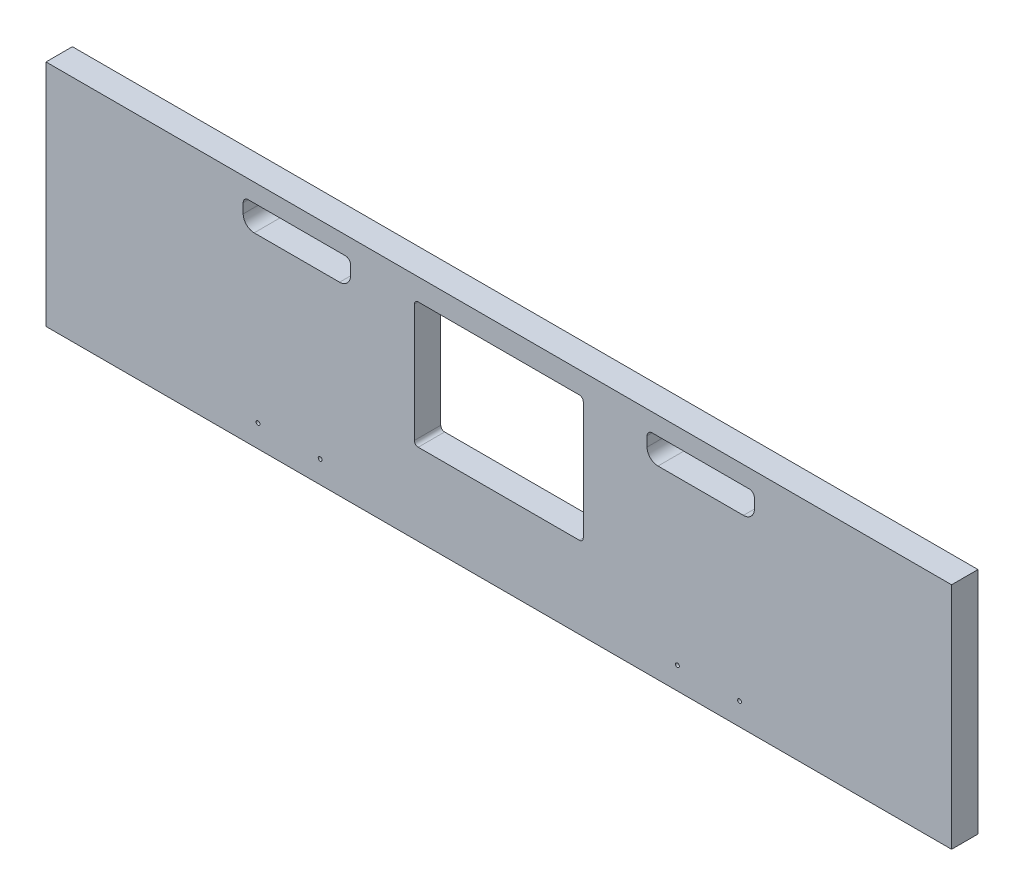
ISO-10303-21;
HEADER;
FILE_DESCRIPTION(('STEP AP214'),'2;1');
FILE_NAME('part.step','',(''),(''),'','','');
FILE_SCHEMA(('AUTOMOTIVE_DESIGN { 1 0 10303 214 1 1 1 1 }'));
ENDSEC;
DATA;
#1=APPLICATION_CONTEXT('core data for automotive mechanical design processes');
#2=APPLICATION_PROTOCOL_DEFINITION('international standard','automotive_design',2000,#1);
#3=PRODUCT_CONTEXT('',#1,'mechanical');
#4=PRODUCT('Part','Part','',(#3));
#5=PRODUCT_RELATED_PRODUCT_CATEGORY('part','',(#4));
#6=PRODUCT_DEFINITION_FORMATION('','',#4);
#7=PRODUCT_DEFINITION_CONTEXT('part definition',#1,'design');
#8=PRODUCT_DEFINITION('design','',#6,#7);
#9=PRODUCT_DEFINITION_SHAPE('','',#8);
#10=(LENGTH_UNIT() NAMED_UNIT(*) SI_UNIT(.MILLI.,.METRE.));
#11=(NAMED_UNIT(*) PLANE_ANGLE_UNIT() SI_UNIT($,.RADIAN.));
#12=(NAMED_UNIT(*) SI_UNIT($,.STERADIAN.) SOLID_ANGLE_UNIT());
#13=UNCERTAINTY_MEASURE_WITH_UNIT(LENGTH_MEASURE(1.E-05),#10,'distance_accuracy_value','');
#14=(GEOMETRIC_REPRESENTATION_CONTEXT(3) GLOBAL_UNCERTAINTY_ASSIGNED_CONTEXT((#13)) GLOBAL_UNIT_ASSIGNED_CONTEXT((#10,
#11,#12)) REPRESENTATION_CONTEXT('',''));
#15=CARTESIAN_POINT('',(0.,0.,0.));
#16=DIRECTION('',(0.,0.,1.));
#17=DIRECTION('',(1.,0.,0.));
#18=AXIS2_PLACEMENT_3D('',#15,#16,#17);
#19=CARTESIAN_POINT('',(-603.25,-5502.275,-21.59));
#20=DIRECTION('',(0.,-1.,0.));
#21=DIRECTION('',(0.,0.,-1.));
#22=AXIS2_PLACEMENT_3D('',#19,#20,#21);
#23=PLANE('',#22);
#24=DIRECTION('',(1.,0.,0.));
#25=VECTOR('',#24,1.);
#26=CARTESIAN_POINT('',(-603.25,-5502.275,0.));
#27=LINE('',#26,#25);
#28=CARTESIAN_POINT('',(-603.25,-5502.275,0.));
#29=VERTEX_POINT('',#28);
#30=CARTESIAN_POINT('',(137.16,-5502.275,0.));
#31=VERTEX_POINT('',#30);
#32=EDGE_CURVE('E382',#29,#31,#27,.T.);
#33=ORIENTED_EDGE('',*,*,#32,.F.);
#34=DIRECTION('',(0.,0.,1.));
#35=VECTOR('',#34,1.);
#36=CARTESIAN_POINT('',(-603.25,-5502.275,-21.59));
#37=LINE('',#36,#35);
#38=CARTESIAN_POINT('',(-603.25,-5502.275,-21.59));
#39=VERTEX_POINT('',#38);
#40=EDGE_CURVE('E11',#39,#29,#37,.T.);
#41=ORIENTED_EDGE('',*,*,#40,.F.);
#42=DIRECTION('',(1.,0.,0.));
#43=VECTOR('',#42,1.);
#44=CARTESIAN_POINT('',(-603.25,-5502.275,-21.59));
#45=LINE('',#44,#43);
#46=CARTESIAN_POINT('',(137.16,-5502.275,-21.59));
#47=VERTEX_POINT('',#46);
#48=EDGE_CURVE('E383',#39,#47,#45,.T.);
#49=ORIENTED_EDGE('',*,*,#48,.T.);
#50=DIRECTION('',(0.,0.,1.));
#51=VECTOR('',#50,1.);
#52=CARTESIAN_POINT('',(137.16,-5502.275,-21.59));
#53=LINE('',#52,#51);
#54=EDGE_CURVE('E34',#47,#31,#53,.T.);
#55=ORIENTED_EDGE('',*,*,#54,.T.);
#56=EDGE_LOOP('',(#33,#41,#49,#55));
#57=FACE_BOUND('',#56,.T.);
#58=ADVANCED_FACE('F31',(#57),#23,.T.);
#59=CARTESIAN_POINT('',(-603.25,-5314.95,-21.59));
#60=DIRECTION('',(-1.,0.,0.));
#61=DIRECTION('',(0.,0.,1.));
#62=AXIS2_PLACEMENT_3D('',#59,#60,#61);
#63=PLANE('',#62);
#64=DIRECTION('',(0.,-1.,0.));
#65=VECTOR('',#64,1.);
#66=CARTESIAN_POINT('',(-603.25,-5314.95,0.));
#67=LINE('',#66,#65);
#68=CARTESIAN_POINT('',(-603.25,-5314.95,0.));
#69=VERTEX_POINT('',#68);
#70=EDGE_CURVE('E387',#69,#29,#67,.T.);
#71=ORIENTED_EDGE('',*,*,#70,.F.);
#72=DIRECTION('',(0.,0.,1.));
#73=VECTOR('',#72,1.);
#74=CARTESIAN_POINT('',(-603.25,-5314.95,-21.59));
#75=LINE('',#74,#73);
#76=CARTESIAN_POINT('',(-603.25,-5314.95,-21.59));
#77=VERTEX_POINT('',#76);
#78=EDGE_CURVE('E39',#77,#69,#75,.T.);
#79=ORIENTED_EDGE('',*,*,#78,.F.);
#80=DIRECTION('',(0.,-1.,0.));
#81=VECTOR('',#80,1.);
#82=CARTESIAN_POINT('',(-603.25,-5314.95,-21.59));
#83=LINE('',#82,#81);
#84=EDGE_CURVE('E393',#77,#39,#83,.T.);
#85=ORIENTED_EDGE('',*,*,#84,.T.);
#86=ORIENTED_EDGE('',*,*,#40,.T.);
#87=EDGE_LOOP('',(#71,#79,#85,#86));
#88=FACE_BOUND('',#87,.T.);
#89=ADVANCED_FACE('F418',(#88),#63,.T.);
#90=CARTESIAN_POINT('',(137.16,-5314.95,-21.59));
#91=DIRECTION('',(0.,1.,0.));
#92=DIRECTION('',(0.,0.,1.));
#93=AXIS2_PLACEMENT_3D('',#90,#91,#92);
#94=PLANE('',#93);
#95=DIRECTION('',(-1.,0.,0.));
#96=VECTOR('',#95,1.);
#97=CARTESIAN_POINT('',(137.16,-5314.95,0.));
#98=LINE('',#97,#96);
#99=CARTESIAN_POINT('',(137.16,-5314.95,0.));
#100=VERTEX_POINT('',#99);
#101=EDGE_CURVE('E401',#100,#69,#98,.T.);
#102=ORIENTED_EDGE('',*,*,#101,.F.);
#103=DIRECTION('',(0.,0.,1.));
#104=VECTOR('',#103,1.);
#105=CARTESIAN_POINT('',(137.16,-5314.95,-21.59));
#106=LINE('',#105,#104);
#107=CARTESIAN_POINT('',(137.16,-5314.95,-21.59));
#108=VERTEX_POINT('',#107);
#109=EDGE_CURVE('E406',#108,#100,#106,.T.);
#110=ORIENTED_EDGE('',*,*,#109,.F.);
#111=DIRECTION('',(-1.,0.,0.));
#112=VECTOR('',#111,1.);
#113=CARTESIAN_POINT('',(137.16,-5314.95,-21.59));
#114=LINE('',#113,#112);
#115=EDGE_CURVE('E390',#108,#77,#114,.T.);
#116=ORIENTED_EDGE('',*,*,#115,.T.);
#117=ORIENTED_EDGE('',*,*,#78,.T.);
#118=EDGE_LOOP('',(#102,#110,#116,#117));
#119=FACE_BOUND('',#118,.T.);
#120=ADVANCED_FACE('F424',(#119),#94,.T.);
#121=CARTESIAN_POINT('',(137.16,-5502.275,-21.59));
#122=DIRECTION('',(1.,0.,0.));
#123=DIRECTION('',(0.,0.,-1.));
#124=AXIS2_PLACEMENT_3D('',#121,#122,#123);
#125=PLANE('',#124);
#126=DIRECTION('',(0.,1.,0.));
#127=VECTOR('',#126,1.);
#128=CARTESIAN_POINT('',(137.16,-5502.275,0.));
#129=LINE('',#128,#127);
#130=EDGE_CURVE('E398',#31,#100,#129,.T.);
#131=ORIENTED_EDGE('',*,*,#130,.F.);
#132=ORIENTED_EDGE('',*,*,#54,.F.);
#133=DIRECTION('',(0.,1.,0.));
#134=VECTOR('',#133,1.);
#135=CARTESIAN_POINT('',(137.16,-5502.275,-21.59));
#136=LINE('',#135,#134);
#137=EDGE_CURVE('E386',#47,#108,#136,.T.);
#138=ORIENTED_EDGE('',*,*,#137,.T.);
#139=ORIENTED_EDGE('',*,*,#109,.T.);
#140=EDGE_LOOP('',(#131,#132,#138,#139));
#141=FACE_BOUND('',#140,.T.);
#142=ADVANCED_FACE('F414',(#141),#125,.T.);
#143=CARTESIAN_POINT('',(137.16,-5502.275,-21.59));
#144=DIRECTION('',(0.,0.,1.));
#145=DIRECTION('',(1.,0.,0.));
#146=AXIS2_PLACEMENT_3D('',#143,#144,#145);
#147=PLANE('',#146);
#148=CARTESIAN_POINT('',(-36.195,-5484.0124,-21.59));
#149=DIRECTION('',(0.,0.,1.));
#150=DIRECTION('',(1.,0.,0.));
#151=AXIS2_PLACEMENT_3D('',#148,#149,#150);
#152=CIRCLE('',#151,1.58749999999976);
#153=CARTESIAN_POINT('',(-34.6075000000002,-5484.0124,-21.59));
#154=VERTEX_POINT('',#153);
#155=EDGE_CURVE('E749',#154,#154,#152,.F.);
#156=ORIENTED_EDGE('',*,*,#155,.F.);
#157=EDGE_LOOP('',(#156));
#158=FACE_BOUND('',#157,.T.);
#159=CARTESIAN_POINT('',(-86.995,-5484.0124,-21.59));
#160=DIRECTION('',(0.,0.,1.));
#161=DIRECTION('',(1.,0.,0.));
#162=AXIS2_PLACEMENT_3D('',#159,#160,#161);
#163=CIRCLE('',#162,1.58749999999993);
#164=CARTESIAN_POINT('',(-85.4075000000001,-5484.0124,-21.59));
#165=VERTEX_POINT('',#164);
#166=EDGE_CURVE('E759',#165,#165,#163,.F.);
#167=ORIENTED_EDGE('',*,*,#166,.F.);
#168=EDGE_LOOP('',(#167));
#169=FACE_BOUND('',#168,.T.);
#170=CARTESIAN_POINT('',(-379.095,-5484.0124,-21.59));
#171=DIRECTION('',(0.,0.,1.));
#172=DIRECTION('',(1.,0.,0.));
#173=AXIS2_PLACEMENT_3D('',#170,#171,#172);
#174=CIRCLE('',#173,1.5874999999999);
#175=CARTESIAN_POINT('',(-377.5075,-5484.0124,-21.59));
#176=VERTEX_POINT('',#175);
#177=EDGE_CURVE('E765',#176,#176,#174,.F.);
#178=ORIENTED_EDGE('',*,*,#177,.F.);
#179=EDGE_LOOP('',(#178));
#180=FACE_BOUND('',#179,.T.);
#181=CARTESIAN_POINT('',(-429.895,-5484.0124,-21.59));
#182=DIRECTION('',(0.,0.,1.));
#183=DIRECTION('',(1.,0.,0.));
#184=AXIS2_PLACEMENT_3D('',#181,#182,#183);
#185=CIRCLE('',#184,1.58749999999996);
#186=CARTESIAN_POINT('',(-428.3075,-5484.0124,-21.59));
#187=VERTEX_POINT('',#186);
#188=EDGE_CURVE('E771',#187,#187,#185,.F.);
#189=ORIENTED_EDGE('',*,*,#188,.F.);
#190=EDGE_LOOP('',(#189));
#191=FACE_BOUND('',#190,.T.);
#192=DIRECTION('',(0.,1.,0.));
#193=VECTOR('',#192,1.);
#194=CARTESIAN_POINT('',(-111.8235,-5334.,-21.59));
#195=LINE('',#194,#193);
#196=CARTESIAN_POINT('',(-111.8235,-5341.9375,-21.59));
#197=VERTEX_POINT('',#196);
#198=CARTESIAN_POINT('',(-111.8235,-5334.,-21.59));
#199=VERTEX_POINT('',#198);
#200=EDGE_CURVE('E783',#197,#199,#195,.T.);
#201=ORIENTED_EDGE('',*,*,#200,.F.);
#202=CARTESIAN_POINT('',(-102.869999999999,-5341.9375,-21.59));
#203=DIRECTION('',(0.,0.,1.));
#204=DIRECTION('',(1.,0.,0.));
#205=AXIS2_PLACEMENT_3D('',#202,#203,#204);
#206=CIRCLE('',#205,8.9535000000005);
#207=CARTESIAN_POINT('',(-102.87,-5350.891,-21.59));
#208=VERTEX_POINT('',#207);
#209=EDGE_CURVE('E268',#208,#197,#206,.F.);
#210=ORIENTED_EDGE('',*,*,#209,.F.);
#211=DIRECTION('',(-1.,0.,0.));
#212=VECTOR('',#211,1.);
#213=CARTESIAN_POINT('',(-102.87,-5350.891,-21.59));
#214=LINE('',#213,#212);
#215=CARTESIAN_POINT('',(-33.02,-5350.891,-21.59));
#216=VERTEX_POINT('',#215);
#217=EDGE_CURVE('E265',#216,#208,#214,.T.);
#218=ORIENTED_EDGE('',*,*,#217,.F.);
#219=CARTESIAN_POINT('',(-33.02,-5341.9375,-21.59));
#220=DIRECTION('',(0.,0.,1.));
#221=DIRECTION('',(1.,0.,0.));
#222=AXIS2_PLACEMENT_3D('',#219,#220,#221);
#223=CIRCLE('',#222,8.95349999999981);
#224=CARTESIAN_POINT('',(-24.0665000000002,-5341.9375,-21.59));
#225=VERTEX_POINT('',#224);
#226=EDGE_CURVE('E222',#225,#216,#223,.F.);
#227=ORIENTED_EDGE('',*,*,#226,.F.);
#228=DIRECTION('',(0.,-1.,0.));
#229=VECTOR('',#228,1.);
#230=CARTESIAN_POINT('',(-24.0665,-5341.9375,-21.59));
#231=LINE('',#230,#229);
#232=CARTESIAN_POINT('',(-24.0665,-5334.,-21.59));
#233=VERTEX_POINT('',#232);
#234=EDGE_CURVE('E775',#233,#225,#231,.T.);
#235=ORIENTED_EDGE('',*,*,#234,.F.);
#236=CARTESIAN_POINT('',(-28.2574999999992,-5334.,-21.59));
#237=DIRECTION('',(0.,0.,1.));
#238=DIRECTION('',(1.,0.,0.));
#239=AXIS2_PLACEMENT_3D('',#236,#237,#238);
#240=CIRCLE('',#239,4.19099999999939);
#241=CARTESIAN_POINT('',(-28.2575,-5329.809,-21.59));
#242=VERTEX_POINT('',#241);
#243=EDGE_CURVE('E777',#242,#233,#240,.F.);
#244=ORIENTED_EDGE('',*,*,#243,.F.);
#245=DIRECTION('',(1.,0.,0.));
#246=VECTOR('',#245,1.);
#247=CARTESIAN_POINT('',(-28.2575,-5329.809,-21.59));
#248=LINE('',#247,#246);
#249=CARTESIAN_POINT('',(-107.6325,-5329.809,-21.59));
#250=VERTEX_POINT('',#249);
#251=EDGE_CURVE('E779',#250,#242,#248,.T.);
#252=ORIENTED_EDGE('',*,*,#251,.F.);
#253=CARTESIAN_POINT('',(-107.6325,-5334.,-21.59));
#254=DIRECTION('',(0.,0.,1.));
#255=DIRECTION('',(1.,0.,0.));
#256=AXIS2_PLACEMENT_3D('',#253,#254,#255);
#257=CIRCLE('',#256,4.19100000000025);
#258=EDGE_CURVE('E781',#199,#250,#257,.F.);
#259=ORIENTED_EDGE('',*,*,#258,.F.);
#260=EDGE_LOOP('',(#201,#210,#218,#227,#235,#244,#252,#259));
#261=FACE_BOUND('',#260,.T.);
#262=DIRECTION('',(0.,-1.,0.));
#263=VECTOR('',#262,1.);
#264=CARTESIAN_POINT('',(-354.2665,-5334.,-21.59));
#265=LINE('',#264,#263);
#266=CARTESIAN_POINT('',(-354.2665,-5334.,-21.59));
#267=VERTEX_POINT('',#266);
#268=CARTESIAN_POINT('',(-354.2665,-5341.9375,-21.59));
#269=VERTEX_POINT('',#268);
#270=EDGE_CURVE('E281',#267,#269,#265,.T.);
#271=ORIENTED_EDGE('',*,*,#270,.F.);
#272=CARTESIAN_POINT('',(-358.4575,-5334.,-21.59));
#273=DIRECTION('',(0.,0.,1.));
#274=DIRECTION('',(1.,0.,0.));
#275=AXIS2_PLACEMENT_3D('',#272,#273,#274);
#276=CIRCLE('',#275,4.19100000000022);
#277=CARTESIAN_POINT('',(-358.4575,-5329.809,-21.59));
#278=VERTEX_POINT('',#277);
#279=EDGE_CURVE('E283',#278,#267,#276,.F.);
#280=ORIENTED_EDGE('',*,*,#279,.F.);
#281=DIRECTION('',(1.,0.,0.));
#282=VECTOR('',#281,1.);
#283=CARTESIAN_POINT('',(-437.8325,-5329.809,-21.59));
#284=LINE('',#283,#282);
#285=CARTESIAN_POINT('',(-437.8325,-5329.809,-21.59));
#286=VERTEX_POINT('',#285);
#287=EDGE_CURVE('E285',#286,#278,#284,.T.);
#288=ORIENTED_EDGE('',*,*,#287,.F.);
#289=CARTESIAN_POINT('',(-437.832500000001,-5334.,-21.59));
#290=DIRECTION('',(0.,0.,1.));
#291=DIRECTION('',(1.,0.,0.));
#292=AXIS2_PLACEMENT_3D('',#289,#290,#291);
#293=CIRCLE('',#292,4.19099999999939);
#294=CARTESIAN_POINT('',(-442.0235,-5334.,-21.59));
#295=VERTEX_POINT('',#294);
#296=EDGE_CURVE('E269',#295,#286,#293,.F.);
#297=ORIENTED_EDGE('',*,*,#296,.F.);
#298=DIRECTION('',(0.,1.,0.));
#299=VECTOR('',#298,1.);
#300=CARTESIAN_POINT('',(-442.0235,-5341.9375,-21.59));
#301=LINE('',#300,#299);
#302=CARTESIAN_POINT('',(-442.0235,-5341.9375,-21.59));
#303=VERTEX_POINT('',#302);
#304=EDGE_CURVE('E272',#303,#295,#301,.T.);
#305=ORIENTED_EDGE('',*,*,#304,.F.);
#306=CARTESIAN_POINT('',(-433.07,-5341.9375,-21.59));
#307=DIRECTION('',(0.,0.,1.));
#308=DIRECTION('',(1.,0.,0.));
#309=AXIS2_PLACEMENT_3D('',#306,#307,#308);
#310=CIRCLE('',#309,8.95349999999978);
#311=CARTESIAN_POINT('',(-433.07,-5350.891,-21.59));
#312=VERTEX_POINT('',#311);
#313=EDGE_CURVE('E275',#312,#303,#310,.F.);
#314=ORIENTED_EDGE('',*,*,#313,.F.);
#315=DIRECTION('',(-1.,0.,0.));
#316=VECTOR('',#315,1.);
#317=CARTESIAN_POINT('',(-363.22,-5350.891,-21.59));
#318=LINE('',#317,#316);
#319=CARTESIAN_POINT('',(-363.22,-5350.891,-21.59));
#320=VERTEX_POINT('',#319);
#321=EDGE_CURVE('E277',#320,#312,#318,.T.);
#322=ORIENTED_EDGE('',*,*,#321,.F.);
#323=CARTESIAN_POINT('',(-363.220000000001,-5341.9375,-21.59));
#324=DIRECTION('',(0.,0.,1.));
#325=DIRECTION('',(1.,0.,0.));
#326=AXIS2_PLACEMENT_3D('',#323,#324,#325);
#327=CIRCLE('',#326,8.9535000000005);
#328=EDGE_CURVE('E279',#269,#320,#327,.F.);
#329=ORIENTED_EDGE('',*,*,#328,.F.);
#330=EDGE_LOOP('',(#271,#280,#288,#297,#305,#314,#322,#329));
#331=FACE_BOUND('',#330,.T.);
#332=DIRECTION('',(1.,0.,0.));
#333=VECTOR('',#332,1.);
#334=CARTESIAN_POINT('',(-167.16375,-5332.73,-21.59));
#335=LINE('',#334,#333);
#336=CARTESIAN_POINT('',(-298.92625,-5332.73,-21.59));
#337=VERTEX_POINT('',#336);
#338=CARTESIAN_POINT('',(-167.16375,-5332.73,-21.59));
#339=VERTEX_POINT('',#338);
#340=EDGE_CURVE('E338',#337,#339,#335,.T.);
#341=ORIENTED_EDGE('',*,*,#340,.F.);
#342=CARTESIAN_POINT('',(-298.92625,-5335.905,-21.59));
#343=DIRECTION('',(0.,0.,1.));
#344=DIRECTION('',(1.,0.,0.));
#345=AXIS2_PLACEMENT_3D('',#342,#343,#344);
#346=CIRCLE('',#345,3.17499999999984);
#347=CARTESIAN_POINT('',(-302.10125,-5335.905,-21.59));
#348=VERTEX_POINT('',#347);
#349=EDGE_CURVE('E340',#348,#337,#346,.F.);
#350=ORIENTED_EDGE('',*,*,#349,.F.);
#351=DIRECTION('',(0.,1.,0.));
#352=VECTOR('',#351,1.);
#353=CARTESIAN_POINT('',(-302.10125,-5335.905,-21.59));
#354=LINE('',#353,#352);
#355=CARTESIAN_POINT('',(-302.10125,-5432.425,-21.59));
#356=VERTEX_POINT('',#355);
#357=EDGE_CURVE('E342',#356,#348,#354,.T.);
#358=ORIENTED_EDGE('',*,*,#357,.F.);
#359=CARTESIAN_POINT('',(-298.926249999999,-5432.425,-21.59));
#360=DIRECTION('',(0.,0.,1.));
#361=DIRECTION('',(1.,0.,0.));
#362=AXIS2_PLACEMENT_3D('',#359,#360,#361);
#363=CIRCLE('',#362,3.17500000000059);
#364=CARTESIAN_POINT('',(-298.92625,-5435.6,-21.59));
#365=VERTEX_POINT('',#364);
#366=EDGE_CURVE('E326',#365,#356,#363,.F.);
#367=ORIENTED_EDGE('',*,*,#366,.F.);
#368=DIRECTION('',(-1.,0.,0.));
#369=VECTOR('',#368,1.);
#370=CARTESIAN_POINT('',(-298.92625,-5435.6,-21.59));
#371=LINE('',#370,#369);
#372=CARTESIAN_POINT('',(-167.16375,-5435.6,-21.59));
#373=VERTEX_POINT('',#372);
#374=EDGE_CURVE('E329',#373,#365,#371,.T.);
#375=ORIENTED_EDGE('',*,*,#374,.F.);
#376=CARTESIAN_POINT('',(-167.16375,-5432.425,-21.59));
#377=DIRECTION('',(0.,0.,1.));
#378=DIRECTION('',(1.,0.,0.));
#379=AXIS2_PLACEMENT_3D('',#376,#377,#378);
#380=CIRCLE('',#379,3.17499999999986);
#381=CARTESIAN_POINT('',(-163.98875,-5432.425,-21.59));
#382=VERTEX_POINT('',#381);
#383=EDGE_CURVE('E332',#382,#373,#380,.F.);
#384=ORIENTED_EDGE('',*,*,#383,.F.);
#385=DIRECTION('',(0.,-1.,0.));
#386=VECTOR('',#385,1.);
#387=CARTESIAN_POINT('',(-163.98875,-5432.425,-21.59));
#388=LINE('',#387,#386);
#389=CARTESIAN_POINT('',(-163.98875,-5335.905,-21.59));
#390=VERTEX_POINT('',#389);
#391=EDGE_CURVE('E334',#390,#382,#388,.T.);
#392=ORIENTED_EDGE('',*,*,#391,.F.);
#393=CARTESIAN_POINT('',(-167.16375,-5335.905,-21.59));
#394=DIRECTION('',(0.,0.,1.));
#395=DIRECTION('',(1.,0.,0.));
#396=AXIS2_PLACEMENT_3D('',#393,#394,#395);
#397=CIRCLE('',#396,3.17499999999993);
#398=EDGE_CURVE('E336',#339,#390,#397,.F.);
#399=ORIENTED_EDGE('',*,*,#398,.F.);
#400=EDGE_LOOP('',(#341,#350,#358,#367,#375,#384,#392,#399));
#401=FACE_BOUND('',#400,.T.);
#402=ORIENTED_EDGE('',*,*,#48,.F.);
#403=ORIENTED_EDGE('',*,*,#84,.F.);
#404=ORIENTED_EDGE('',*,*,#115,.F.);
#405=ORIENTED_EDGE('',*,*,#137,.F.);
#406=EDGE_LOOP('',(#402,#403,#404,#405));
#407=FACE_BOUND('',#406,.T.);
#408=ADVANCED_FACE('F421',(#158,#169,#180,#191,#261,#331,#401,#407),#147,.F.);
#409=CARTESIAN_POINT('',(137.16,-5502.275,0.));
#410=DIRECTION('',(0.,0.,1.));
#411=DIRECTION('',(1.,0.,0.));
#412=AXIS2_PLACEMENT_3D('',#409,#410,#411);
#413=PLANE('',#412);
#414=CARTESIAN_POINT('',(-36.195,-5484.0124,0.));
#415=DIRECTION('',(0.,0.,1.));
#416=DIRECTION('',(1.,0.,0.));
#417=AXIS2_PLACEMENT_3D('',#414,#415,#416);
#418=CIRCLE('',#417,1.58749999999976);
#419=CARTESIAN_POINT('',(-34.6075000000002,-5484.0124,0.));
#420=VERTEX_POINT('',#419);
#421=EDGE_CURVE('E752',#420,#420,#418,.T.);
#422=ORIENTED_EDGE('',*,*,#421,.F.);
#423=EDGE_LOOP('',(#422));
#424=FACE_BOUND('',#423,.T.);
#425=CARTESIAN_POINT('',(-86.995,-5484.0124,0.));
#426=DIRECTION('',(0.,0.,1.));
#427=DIRECTION('',(1.,0.,0.));
#428=AXIS2_PLACEMENT_3D('',#425,#426,#427);
#429=CIRCLE('',#428,1.58749999999993);
#430=CARTESIAN_POINT('',(-85.4075000000001,-5484.0124,0.));
#431=VERTEX_POINT('',#430);
#432=EDGE_CURVE('E754',#431,#431,#429,.T.);
#433=ORIENTED_EDGE('',*,*,#432,.F.);
#434=EDGE_LOOP('',(#433));
#435=FACE_BOUND('',#434,.T.);
#436=CARTESIAN_POINT('',(-379.095,-5484.0124,0.));
#437=DIRECTION('',(0.,0.,1.));
#438=DIRECTION('',(1.,0.,0.));
#439=AXIS2_PLACEMENT_3D('',#436,#437,#438);
#440=CIRCLE('',#439,1.5874999999999);
#441=CARTESIAN_POINT('',(-377.5075,-5484.0124,0.));
#442=VERTEX_POINT('',#441);
#443=EDGE_CURVE('E762',#442,#442,#440,.T.);
#444=ORIENTED_EDGE('',*,*,#443,.F.);
#445=EDGE_LOOP('',(#444));
#446=FACE_BOUND('',#445,.T.);
#447=CARTESIAN_POINT('',(-429.895,-5484.0124,0.));
#448=DIRECTION('',(0.,0.,1.));
#449=DIRECTION('',(1.,0.,0.));
#450=AXIS2_PLACEMENT_3D('',#447,#448,#449);
#451=CIRCLE('',#450,1.58749999999996);
#452=CARTESIAN_POINT('',(-428.3075,-5484.0124,0.));
#453=VERTEX_POINT('',#452);
#454=EDGE_CURVE('E768',#453,#453,#451,.T.);
#455=ORIENTED_EDGE('',*,*,#454,.F.);
#456=EDGE_LOOP('',(#455));
#457=FACE_BOUND('',#456,.T.);
#458=CARTESIAN_POINT('',(-102.869999999999,-5341.9375,0.));
#459=DIRECTION('',(0.,0.,1.));
#460=DIRECTION('',(1.,0.,0.));
#461=AXIS2_PLACEMENT_3D('',#458,#459,#460);
#462=CIRCLE('',#461,8.9535000000005);
#463=CARTESIAN_POINT('',(-111.8235,-5341.9375,0.));
#464=VERTEX_POINT('',#463);
#465=CARTESIAN_POINT('',(-102.87,-5350.891,0.));
#466=VERTEX_POINT('',#465);
#467=EDGE_CURVE('E55',#464,#466,#462,.T.);
#468=ORIENTED_EDGE('',*,*,#467,.F.);
#469=DIRECTION('',(0.,-1.,0.));
#470=VECTOR('',#469,1.);
#471=CARTESIAN_POINT('',(-111.8235,-5334.,0.));
#472=LINE('',#471,#470);
#473=CARTESIAN_POINT('',(-111.8235,-5334.,0.));
#474=VERTEX_POINT('',#473);
#475=EDGE_CURVE('E250',#474,#464,#472,.T.);
#476=ORIENTED_EDGE('',*,*,#475,.F.);
#477=CARTESIAN_POINT('',(-107.6325,-5334.,0.));
#478=DIRECTION('',(0.,0.,1.));
#479=DIRECTION('',(1.,0.,0.));
#480=AXIS2_PLACEMENT_3D('',#477,#478,#479);
#481=CIRCLE('',#480,4.19100000000025);
#482=CARTESIAN_POINT('',(-107.6325,-5329.809,0.));
#483=VERTEX_POINT('',#482);
#484=EDGE_CURVE('E247',#483,#474,#481,.T.);
#485=ORIENTED_EDGE('',*,*,#484,.F.);
#486=DIRECTION('',(-1.,0.,0.));
#487=VECTOR('',#486,1.);
#488=CARTESIAN_POINT('',(-28.2575,-5329.809,0.));
#489=LINE('',#488,#487);
#490=CARTESIAN_POINT('',(-28.2575,-5329.809,0.));
#491=VERTEX_POINT('',#490);
#492=EDGE_CURVE('E244',#491,#483,#489,.T.);
#493=ORIENTED_EDGE('',*,*,#492,.F.);
#494=CARTESIAN_POINT('',(-28.2574999999992,-5334.,0.));
#495=DIRECTION('',(0.,0.,1.));
#496=DIRECTION('',(1.,0.,0.));
#497=AXIS2_PLACEMENT_3D('',#494,#495,#496);
#498=CIRCLE('',#497,4.19099999999939);
#499=CARTESIAN_POINT('',(-24.0665,-5334.,0.));
#500=VERTEX_POINT('',#499);
#501=EDGE_CURVE('E238',#500,#491,#498,.T.);
#502=ORIENTED_EDGE('',*,*,#501,.F.);
#503=DIRECTION('',(0.,1.,0.));
#504=VECTOR('',#503,1.);
#505=CARTESIAN_POINT('',(-24.0665,-5341.9375,0.));
#506=LINE('',#505,#504);
#507=CARTESIAN_POINT('',(-24.0665000000002,-5341.9375,0.));
#508=VERTEX_POINT('',#507);
#509=EDGE_CURVE('E236',#508,#500,#506,.T.);
#510=ORIENTED_EDGE('',*,*,#509,.F.);
#511=CARTESIAN_POINT('',(-33.02,-5341.9375,0.));
#512=DIRECTION('',(0.,0.,1.));
#513=DIRECTION('',(1.,0.,0.));
#514=AXIS2_PLACEMENT_3D('',#511,#512,#513);
#515=CIRCLE('',#514,8.95349999999981);
#516=CARTESIAN_POINT('',(-33.02,-5350.891,0.));
#517=VERTEX_POINT('',#516);
#518=EDGE_CURVE('E219',#517,#508,#515,.T.);
#519=ORIENTED_EDGE('',*,*,#518,.F.);
#520=DIRECTION('',(1.,0.,0.));
#521=VECTOR('',#520,1.);
#522=CARTESIAN_POINT('',(-102.87,-5350.891,0.));
#523=LINE('',#522,#521);
#524=EDGE_CURVE('E228',#466,#517,#523,.T.);
#525=ORIENTED_EDGE('',*,*,#524,.F.);
#526=EDGE_LOOP('',(#468,#476,#485,#493,#502,#510,#519,#525));
#527=FACE_BOUND('',#526,.T.);
#528=CARTESIAN_POINT('',(-358.4575,-5334.,0.));
#529=DIRECTION('',(0.,0.,1.));
#530=DIRECTION('',(-1.,0.,0.));
#531=AXIS2_PLACEMENT_3D('',#528,#529,#530);
#532=CIRCLE('',#531,4.19100000000022);
#533=CARTESIAN_POINT('',(-354.2665,-5334.,0.));
#534=VERTEX_POINT('',#533);
#535=CARTESIAN_POINT('',(-358.4575,-5329.809,0.));
#536=VERTEX_POINT('',#535);
#537=EDGE_CURVE('E267',#534,#536,#532,.T.);
#538=ORIENTED_EDGE('',*,*,#537,.F.);
#539=DIRECTION('',(0.,1.,0.));
#540=VECTOR('',#539,1.);
#541=CARTESIAN_POINT('',(-354.2665,-5334.,0.));
#542=LINE('',#541,#540);
#543=CARTESIAN_POINT('',(-354.2665,-5341.9375,0.));
#544=VERTEX_POINT('',#543);
#545=EDGE_CURVE('E305',#544,#534,#542,.T.);
#546=ORIENTED_EDGE('',*,*,#545,.F.);
#547=CARTESIAN_POINT('',(-363.220000000001,-5341.9375,0.));
#548=DIRECTION('',(0.,0.,1.));
#549=DIRECTION('',(-1.,0.,0.));
#550=AXIS2_PLACEMENT_3D('',#547,#548,#549);
#551=CIRCLE('',#550,8.9535000000005);
#552=CARTESIAN_POINT('',(-363.22,-5350.891,0.));
#553=VERTEX_POINT('',#552);
#554=EDGE_CURVE('E302',#553,#544,#551,.T.);
#555=ORIENTED_EDGE('',*,*,#554,.F.);
#556=DIRECTION('',(1.,0.,0.));
#557=VECTOR('',#556,1.);
#558=CARTESIAN_POINT('',(-363.22,-5350.891,0.));
#559=LINE('',#558,#557);
#560=CARTESIAN_POINT('',(-433.07,-5350.891,0.));
#561=VERTEX_POINT('',#560);
#562=EDGE_CURVE('E299',#561,#553,#559,.T.);
#563=ORIENTED_EDGE('',*,*,#562,.F.);
#564=CARTESIAN_POINT('',(-433.07,-5341.9375,0.));
#565=DIRECTION('',(0.,0.,1.));
#566=DIRECTION('',(-1.,0.,0.));
#567=AXIS2_PLACEMENT_3D('',#564,#565,#566);
#568=CIRCLE('',#567,8.95349999999978);
#569=CARTESIAN_POINT('',(-442.0235,-5341.9375,0.));
#570=VERTEX_POINT('',#569);
#571=EDGE_CURVE('E296',#570,#561,#568,.T.);
#572=ORIENTED_EDGE('',*,*,#571,.F.);
#573=DIRECTION('',(0.,-1.,0.));
#574=VECTOR('',#573,1.);
#575=CARTESIAN_POINT('',(-442.0235,-5341.9375,0.));
#576=LINE('',#575,#574);
#577=CARTESIAN_POINT('',(-442.0235,-5334.,0.));
#578=VERTEX_POINT('',#577);
#579=EDGE_CURVE('E293',#578,#570,#576,.T.);
#580=ORIENTED_EDGE('',*,*,#579,.F.);
#581=CARTESIAN_POINT('',(-437.832500000001,-5334.,0.));
#582=DIRECTION('',(0.,0.,1.));
#583=DIRECTION('',(-1.,0.,0.));
#584=AXIS2_PLACEMENT_3D('',#581,#582,#583);
#585=CIRCLE('',#584,4.19099999999939);
#586=CARTESIAN_POINT('',(-437.8325,-5329.809,0.));
#587=VERTEX_POINT('',#586);
#588=EDGE_CURVE('E290',#587,#578,#585,.T.);
#589=ORIENTED_EDGE('',*,*,#588,.F.);
#590=DIRECTION('',(-1.,0.,0.));
#591=VECTOR('',#590,1.);
#592=CARTESIAN_POINT('',(-437.8325,-5329.809,0.));
#593=LINE('',#592,#591);
#594=EDGE_CURVE('E287',#536,#587,#593,.T.);
#595=ORIENTED_EDGE('',*,*,#594,.F.);
#596=EDGE_LOOP('',(#538,#546,#555,#563,#572,#580,#589,#595));
#597=FACE_BOUND('',#596,.T.);
#598=CARTESIAN_POINT('',(-298.92625,-5335.905,0.));
#599=DIRECTION('',(0.,0.,1.));
#600=DIRECTION('',(1.,0.,0.));
#601=AXIS2_PLACEMENT_3D('',#598,#599,#600);
#602=CIRCLE('',#601,3.17499999999984);
#603=CARTESIAN_POINT('',(-298.92625,-5332.73,0.));
#604=VERTEX_POINT('',#603);
#605=CARTESIAN_POINT('',(-302.10125,-5335.905,0.));
#606=VERTEX_POINT('',#605);
#607=EDGE_CURVE('E325',#604,#606,#602,.T.);
#608=ORIENTED_EDGE('',*,*,#607,.F.);
#609=DIRECTION('',(-1.,0.,0.));
#610=VECTOR('',#609,1.);
#611=CARTESIAN_POINT('',(-167.16375,-5332.73,0.));
#612=LINE('',#611,#610);
#613=CARTESIAN_POINT('',(-167.16375,-5332.73,0.));
#614=VERTEX_POINT('',#613);
#615=EDGE_CURVE('E362',#614,#604,#612,.T.);
#616=ORIENTED_EDGE('',*,*,#615,.F.);
#617=CARTESIAN_POINT('',(-167.16375,-5335.905,0.));
#618=DIRECTION('',(0.,0.,1.));
#619=DIRECTION('',(1.,0.,0.));
#620=AXIS2_PLACEMENT_3D('',#617,#618,#619);
#621=CIRCLE('',#620,3.17499999999993);
#622=CARTESIAN_POINT('',(-163.98875,-5335.905,0.));
#623=VERTEX_POINT('',#622);
#624=EDGE_CURVE('E359',#623,#614,#621,.T.);
#625=ORIENTED_EDGE('',*,*,#624,.F.);
#626=DIRECTION('',(0.,1.,0.));
#627=VECTOR('',#626,1.);
#628=CARTESIAN_POINT('',(-163.98875,-5432.425,0.));
#629=LINE('',#628,#627);
#630=CARTESIAN_POINT('',(-163.98875,-5432.425,0.));
#631=VERTEX_POINT('',#630);
#632=EDGE_CURVE('E356',#631,#623,#629,.T.);
#633=ORIENTED_EDGE('',*,*,#632,.F.);
#634=CARTESIAN_POINT('',(-167.16375,-5432.425,0.));
#635=DIRECTION('',(0.,0.,1.));
#636=DIRECTION('',(1.,0.,0.));
#637=AXIS2_PLACEMENT_3D('',#634,#635,#636);
#638=CIRCLE('',#637,3.17499999999986);
#639=CARTESIAN_POINT('',(-167.16375,-5435.6,0.));
#640=VERTEX_POINT('',#639);
#641=EDGE_CURVE('E353',#640,#631,#638,.T.);
#642=ORIENTED_EDGE('',*,*,#641,.F.);
#643=DIRECTION('',(1.,0.,0.));
#644=VECTOR('',#643,1.);
#645=CARTESIAN_POINT('',(-298.92625,-5435.6,0.));
#646=LINE('',#645,#644);
#647=CARTESIAN_POINT('',(-298.92625,-5435.6,0.));
#648=VERTEX_POINT('',#647);
#649=EDGE_CURVE('E350',#648,#640,#646,.T.);
#650=ORIENTED_EDGE('',*,*,#649,.F.);
#651=CARTESIAN_POINT('',(-298.926249999999,-5432.425,0.));
#652=DIRECTION('',(0.,0.,1.));
#653=DIRECTION('',(1.,0.,0.));
#654=AXIS2_PLACEMENT_3D('',#651,#652,#653);
#655=CIRCLE('',#654,3.17500000000059);
#656=CARTESIAN_POINT('',(-302.10125,-5432.425,0.));
#657=VERTEX_POINT('',#656);
#658=EDGE_CURVE('E347',#657,#648,#655,.T.);
#659=ORIENTED_EDGE('',*,*,#658,.F.);
#660=DIRECTION('',(0.,-1.,0.));
#661=VECTOR('',#660,1.);
#662=CARTESIAN_POINT('',(-302.10125,-5335.905,0.));
#663=LINE('',#662,#661);
#664=EDGE_CURVE('E344',#606,#657,#663,.T.);
#665=ORIENTED_EDGE('',*,*,#664,.F.);
#666=EDGE_LOOP('',(#608,#616,#625,#633,#642,#650,#659,#665));
#667=FACE_BOUND('',#666,.T.);
#668=ORIENTED_EDGE('',*,*,#32,.T.);
#669=ORIENTED_EDGE('',*,*,#130,.T.);
#670=ORIENTED_EDGE('',*,*,#101,.T.);
#671=ORIENTED_EDGE('',*,*,#70,.T.);
#672=EDGE_LOOP('',(#668,#669,#670,#671));
#673=FACE_BOUND('',#672,.T.);
#674=ADVANCED_FACE('F232',(#424,#435,#446,#457,#527,#597,#667,#673),#413,.T.);
#675=CARTESIAN_POINT('',(-298.92625,-5335.905,-193.802948282788));
#676=DIRECTION('',(0.,0.,1.));
#677=DIRECTION('',(1.,0.,0.));
#678=AXIS2_PLACEMENT_3D('',#675,#676,#677);
#679=CYLINDRICAL_SURFACE('',#678,3.17499999999984);
#680=ORIENTED_EDGE('',*,*,#349,.T.);
#681=DIRECTION('',(0.,0.,1.));
#682=VECTOR('',#681,1.);
#683=CARTESIAN_POINT('',(-298.92625,-5332.73,-193.802948282788));
#684=LINE('',#683,#682);
#685=EDGE_CURVE('E330',#337,#604,#684,.T.);
#686=ORIENTED_EDGE('',*,*,#685,.T.);
#687=ORIENTED_EDGE('',*,*,#607,.T.);
#688=DIRECTION('',(0.,0.,1.));
#689=VECTOR('',#688,1.);
#690=CARTESIAN_POINT('',(-302.10125,-5335.905,-193.802948282788));
#691=LINE('',#690,#689);
#692=EDGE_CURVE('E365',#348,#606,#691,.T.);
#693=ORIENTED_EDGE('',*,*,#692,.F.);
#694=EDGE_LOOP('',(#680,#686,#687,#693));
#695=FACE_BOUND('',#694,.T.);
#696=ADVANCED_FACE('F467',(#695),#679,.F.);
#697=CARTESIAN_POINT('',(-167.16375,-5332.73,-193.802948282788));
#698=DIRECTION('',(0.,1.,0.));
#699=DIRECTION('',(0.,0.,1.));
#700=AXIS2_PLACEMENT_3D('',#697,#698,#699);
#701=PLANE('',#700);
#702=ORIENTED_EDGE('',*,*,#340,.T.);
#703=DIRECTION('',(0.,0.,1.));
#704=VECTOR('',#703,1.);
#705=CARTESIAN_POINT('',(-167.16375,-5332.73,-193.802948282788));
#706=LINE('',#705,#704);
#707=EDGE_CURVE('E367',#339,#614,#706,.T.);
#708=ORIENTED_EDGE('',*,*,#707,.T.);
#709=ORIENTED_EDGE('',*,*,#615,.T.);
#710=ORIENTED_EDGE('',*,*,#685,.F.);
#711=EDGE_LOOP('',(#702,#708,#709,#710));
#712=FACE_BOUND('',#711,.T.);
#713=ADVANCED_FACE('F477',(#712),#701,.F.);
#714=CARTESIAN_POINT('',(-167.16375,-5335.905,-193.802948282788));
#715=DIRECTION('',(0.,0.,1.));
#716=DIRECTION('',(1.,0.,0.));
#717=AXIS2_PLACEMENT_3D('',#714,#715,#716);
#718=CYLINDRICAL_SURFACE('',#717,3.17499999999993);
#719=ORIENTED_EDGE('',*,*,#398,.T.);
#720=DIRECTION('',(0.,0.,1.));
#721=VECTOR('',#720,1.);
#722=CARTESIAN_POINT('',(-163.98875,-5335.905,-193.802948282788));
#723=LINE('',#722,#721);
#724=EDGE_CURVE('E369',#390,#623,#723,.T.);
#725=ORIENTED_EDGE('',*,*,#724,.T.);
#726=ORIENTED_EDGE('',*,*,#624,.T.);
#727=ORIENTED_EDGE('',*,*,#707,.F.);
#728=EDGE_LOOP('',(#719,#725,#726,#727));
#729=FACE_BOUND('',#728,.T.);
#730=ADVANCED_FACE('F487',(#729),#718,.F.);
#731=CARTESIAN_POINT('',(-163.98875,-5432.425,-193.802948282788));
#732=DIRECTION('',(1.,0.,0.));
#733=DIRECTION('',(0.,0.,-1.));
#734=AXIS2_PLACEMENT_3D('',#731,#732,#733);
#735=PLANE('',#734);
#736=ORIENTED_EDGE('',*,*,#391,.T.);
#737=DIRECTION('',(0.,0.,1.));
#738=VECTOR('',#737,1.);
#739=CARTESIAN_POINT('',(-163.98875,-5432.425,-193.802948282788));
#740=LINE('',#739,#738);
#741=EDGE_CURVE('E371',#382,#631,#740,.T.);
#742=ORIENTED_EDGE('',*,*,#741,.T.);
#743=ORIENTED_EDGE('',*,*,#632,.T.);
#744=ORIENTED_EDGE('',*,*,#724,.F.);
#745=EDGE_LOOP('',(#736,#742,#743,#744));
#746=FACE_BOUND('',#745,.T.);
#747=ADVANCED_FACE('F497',(#746),#735,.F.);
#748=CARTESIAN_POINT('',(-167.16375,-5432.425,-193.802948282788));
#749=DIRECTION('',(0.,0.,1.));
#750=DIRECTION('',(1.,0.,0.));
#751=AXIS2_PLACEMENT_3D('',#748,#749,#750);
#752=CYLINDRICAL_SURFACE('',#751,3.17499999999986);
#753=ORIENTED_EDGE('',*,*,#383,.T.);
#754=DIRECTION('',(0.,0.,1.));
#755=VECTOR('',#754,1.);
#756=CARTESIAN_POINT('',(-167.16375,-5435.6,-193.802948282788));
#757=LINE('',#756,#755);
#758=EDGE_CURVE('E373',#373,#640,#757,.T.);
#759=ORIENTED_EDGE('',*,*,#758,.T.);
#760=ORIENTED_EDGE('',*,*,#641,.T.);
#761=ORIENTED_EDGE('',*,*,#741,.F.);
#762=EDGE_LOOP('',(#753,#759,#760,#761));
#763=FACE_BOUND('',#762,.T.);
#764=ADVANCED_FACE('F507',(#763),#752,.F.);
#765=CARTESIAN_POINT('',(-298.92625,-5435.6,-193.802948282788));
#766=DIRECTION('',(0.,-1.,0.));
#767=DIRECTION('',(0.,0.,-1.));
#768=AXIS2_PLACEMENT_3D('',#765,#766,#767);
#769=PLANE('',#768);
#770=ORIENTED_EDGE('',*,*,#374,.T.);
#771=DIRECTION('',(0.,0.,1.));
#772=VECTOR('',#771,1.);
#773=CARTESIAN_POINT('',(-298.92625,-5435.6,-193.802948282788));
#774=LINE('',#773,#772);
#775=EDGE_CURVE('E375',#365,#648,#774,.T.);
#776=ORIENTED_EDGE('',*,*,#775,.T.);
#777=ORIENTED_EDGE('',*,*,#649,.T.);
#778=ORIENTED_EDGE('',*,*,#758,.F.);
#779=EDGE_LOOP('',(#770,#776,#777,#778));
#780=FACE_BOUND('',#779,.T.);
#781=ADVANCED_FACE('F517',(#780),#769,.F.);
#782=CARTESIAN_POINT('',(-298.926249999999,-5432.425,-193.802948282788));
#783=DIRECTION('',(0.,0.,1.));
#784=DIRECTION('',(1.,0.,0.));
#785=AXIS2_PLACEMENT_3D('',#782,#783,#784);
#786=CYLINDRICAL_SURFACE('',#785,3.17500000000059);
#787=ORIENTED_EDGE('',*,*,#366,.T.);
#788=DIRECTION('',(0.,0.,1.));
#789=VECTOR('',#788,1.);
#790=CARTESIAN_POINT('',(-302.10125,-5432.425,-193.802948282788));
#791=LINE('',#790,#789);
#792=EDGE_CURVE('E377',#356,#657,#791,.T.);
#793=ORIENTED_EDGE('',*,*,#792,.T.);
#794=ORIENTED_EDGE('',*,*,#658,.T.);
#795=ORIENTED_EDGE('',*,*,#775,.F.);
#796=EDGE_LOOP('',(#787,#793,#794,#795));
#797=FACE_BOUND('',#796,.T.);
#798=ADVANCED_FACE('F527',(#797),#786,.F.);
#799=CARTESIAN_POINT('',(-302.10125,-5335.905,-193.802948282788));
#800=DIRECTION('',(-1.,0.,0.));
#801=DIRECTION('',(0.,0.,1.));
#802=AXIS2_PLACEMENT_3D('',#799,#800,#801);
#803=PLANE('',#802);
#804=ORIENTED_EDGE('',*,*,#357,.T.);
#805=ORIENTED_EDGE('',*,*,#692,.T.);
#806=ORIENTED_EDGE('',*,*,#664,.T.);
#807=ORIENTED_EDGE('',*,*,#792,.F.);
#808=EDGE_LOOP('',(#804,#805,#806,#807));
#809=FACE_BOUND('',#808,.T.);
#810=ADVANCED_FACE('F537',(#809),#803,.F.);
#811=CARTESIAN_POINT('',(-358.4575,-5334.,-193.802948282788));
#812=DIRECTION('',(0.,0.,1.));
#813=DIRECTION('',(1.,0.,0.));
#814=AXIS2_PLACEMENT_3D('',#811,#812,#813);
#815=CYLINDRICAL_SURFACE('',#814,4.19100000000022);
#816=ORIENTED_EDGE('',*,*,#279,.T.);
#817=DIRECTION('',(0.,0.,1.));
#818=VECTOR('',#817,1.);
#819=CARTESIAN_POINT('',(-354.2665,-5334.,-193.802948282788));
#820=LINE('',#819,#818);
#821=EDGE_CURVE('E273',#267,#534,#820,.T.);
#822=ORIENTED_EDGE('',*,*,#821,.T.);
#823=ORIENTED_EDGE('',*,*,#537,.T.);
#824=DIRECTION('',(0.,0.,1.));
#825=VECTOR('',#824,1.);
#826=CARTESIAN_POINT('',(-358.4575,-5329.809,-193.802948282788));
#827=LINE('',#826,#825);
#828=EDGE_CURVE('E308',#278,#536,#827,.T.);
#829=ORIENTED_EDGE('',*,*,#828,.F.);
#830=EDGE_LOOP('',(#816,#822,#823,#829));
#831=FACE_BOUND('',#830,.T.);
#832=ADVANCED_FACE('F547',(#831),#815,.F.);
#833=CARTESIAN_POINT('',(-354.2665,-5334.,-193.802948282788));
#834=DIRECTION('',(1.,0.,0.));
#835=DIRECTION('',(0.,0.,-1.));
#836=AXIS2_PLACEMENT_3D('',#833,#834,#835);
#837=PLANE('',#836);
#838=ORIENTED_EDGE('',*,*,#270,.T.);
#839=DIRECTION('',(0.,0.,1.));
#840=VECTOR('',#839,1.);
#841=CARTESIAN_POINT('',(-354.2665,-5341.9375,-193.802948282788));
#842=LINE('',#841,#840);
#843=EDGE_CURVE('E310',#269,#544,#842,.T.);
#844=ORIENTED_EDGE('',*,*,#843,.T.);
#845=ORIENTED_EDGE('',*,*,#545,.T.);
#846=ORIENTED_EDGE('',*,*,#821,.F.);
#847=EDGE_LOOP('',(#838,#844,#845,#846));
#848=FACE_BOUND('',#847,.T.);
#849=ADVANCED_FACE('F557',(#848),#837,.F.);
#850=CARTESIAN_POINT('',(-363.220000000001,-5341.9375,-193.802948282788));
#851=DIRECTION('',(0.,0.,1.));
#852=DIRECTION('',(1.,0.,0.));
#853=AXIS2_PLACEMENT_3D('',#850,#851,#852);
#854=CYLINDRICAL_SURFACE('',#853,8.9535000000005);
#855=ORIENTED_EDGE('',*,*,#328,.T.);
#856=DIRECTION('',(0.,0.,1.));
#857=VECTOR('',#856,1.);
#858=CARTESIAN_POINT('',(-363.22,-5350.891,-193.802948282788));
#859=LINE('',#858,#857);
#860=EDGE_CURVE('E312',#320,#553,#859,.T.);
#861=ORIENTED_EDGE('',*,*,#860,.T.);
#862=ORIENTED_EDGE('',*,*,#554,.T.);
#863=ORIENTED_EDGE('',*,*,#843,.F.);
#864=EDGE_LOOP('',(#855,#861,#862,#863));
#865=FACE_BOUND('',#864,.T.);
#866=ADVANCED_FACE('F567',(#865),#854,.F.);
#867=CARTESIAN_POINT('',(-363.22,-5350.891,-193.802948282788));
#868=DIRECTION('',(0.,-1.,0.));
#869=DIRECTION('',(0.,0.,-1.));
#870=AXIS2_PLACEMENT_3D('',#867,#868,#869);
#871=PLANE('',#870);
#872=ORIENTED_EDGE('',*,*,#321,.T.);
#873=DIRECTION('',(0.,0.,1.));
#874=VECTOR('',#873,1.);
#875=CARTESIAN_POINT('',(-433.07,-5350.891,-193.802948282788));
#876=LINE('',#875,#874);
#877=EDGE_CURVE('E314',#312,#561,#876,.T.);
#878=ORIENTED_EDGE('',*,*,#877,.T.);
#879=ORIENTED_EDGE('',*,*,#562,.T.);
#880=ORIENTED_EDGE('',*,*,#860,.F.);
#881=EDGE_LOOP('',(#872,#878,#879,#880));
#882=FACE_BOUND('',#881,.T.);
#883=ADVANCED_FACE('F577',(#882),#871,.F.);
#884=CARTESIAN_POINT('',(-433.07,-5341.9375,-193.802948282788));
#885=DIRECTION('',(0.,0.,1.));
#886=DIRECTION('',(1.,0.,0.));
#887=AXIS2_PLACEMENT_3D('',#884,#885,#886);
#888=CYLINDRICAL_SURFACE('',#887,8.95349999999978);
#889=ORIENTED_EDGE('',*,*,#313,.T.);
#890=DIRECTION('',(0.,0.,1.));
#891=VECTOR('',#890,1.);
#892=CARTESIAN_POINT('',(-442.0235,-5341.9375,-193.802948282788));
#893=LINE('',#892,#891);
#894=EDGE_CURVE('E316',#303,#570,#893,.T.);
#895=ORIENTED_EDGE('',*,*,#894,.T.);
#896=ORIENTED_EDGE('',*,*,#571,.T.);
#897=ORIENTED_EDGE('',*,*,#877,.F.);
#898=EDGE_LOOP('',(#889,#895,#896,#897));
#899=FACE_BOUND('',#898,.T.);
#900=ADVANCED_FACE('F587',(#899),#888,.F.);
#901=CARTESIAN_POINT('',(-442.0235,-5341.9375,-193.802948282788));
#902=DIRECTION('',(-1.,0.,0.));
#903=DIRECTION('',(0.,0.,1.));
#904=AXIS2_PLACEMENT_3D('',#901,#902,#903);
#905=PLANE('',#904);
#906=ORIENTED_EDGE('',*,*,#304,.T.);
#907=DIRECTION('',(0.,0.,1.));
#908=VECTOR('',#907,1.);
#909=CARTESIAN_POINT('',(-442.0235,-5334.,-193.802948282788));
#910=LINE('',#909,#908);
#911=EDGE_CURVE('E318',#295,#578,#910,.T.);
#912=ORIENTED_EDGE('',*,*,#911,.T.);
#913=ORIENTED_EDGE('',*,*,#579,.T.);
#914=ORIENTED_EDGE('',*,*,#894,.F.);
#915=EDGE_LOOP('',(#906,#912,#913,#914));
#916=FACE_BOUND('',#915,.T.);
#917=ADVANCED_FACE('F597',(#916),#905,.F.);
#918=CARTESIAN_POINT('',(-437.832500000001,-5334.,-193.802948282788));
#919=DIRECTION('',(0.,0.,1.));
#920=DIRECTION('',(1.,0.,0.));
#921=AXIS2_PLACEMENT_3D('',#918,#919,#920);
#922=CYLINDRICAL_SURFACE('',#921,4.19099999999939);
#923=ORIENTED_EDGE('',*,*,#296,.T.);
#924=DIRECTION('',(0.,0.,1.));
#925=VECTOR('',#924,1.);
#926=CARTESIAN_POINT('',(-437.8325,-5329.809,-193.802948282788));
#927=LINE('',#926,#925);
#928=EDGE_CURVE('E320',#286,#587,#927,.T.);
#929=ORIENTED_EDGE('',*,*,#928,.T.);
#930=ORIENTED_EDGE('',*,*,#588,.T.);
#931=ORIENTED_EDGE('',*,*,#911,.F.);
#932=EDGE_LOOP('',(#923,#929,#930,#931));
#933=FACE_BOUND('',#932,.T.);
#934=ADVANCED_FACE('F607',(#933),#922,.F.);
#935=CARTESIAN_POINT('',(-437.8325,-5329.809,-193.802948282788));
#936=DIRECTION('',(0.,1.,0.));
#937=DIRECTION('',(0.,0.,1.));
#938=AXIS2_PLACEMENT_3D('',#935,#936,#937);
#939=PLANE('',#938);
#940=ORIENTED_EDGE('',*,*,#287,.T.);
#941=ORIENTED_EDGE('',*,*,#828,.T.);
#942=ORIENTED_EDGE('',*,*,#594,.T.);
#943=ORIENTED_EDGE('',*,*,#928,.F.);
#944=EDGE_LOOP('',(#940,#941,#942,#943));
#945=FACE_BOUND('',#944,.T.);
#946=ADVANCED_FACE('F617',(#945),#939,.F.);
#947=CARTESIAN_POINT('',(-102.869999999999,-5341.9375,-193.802948282788));
#948=DIRECTION('',(0.,0.,1.));
#949=DIRECTION('',(1.,0.,0.));
#950=AXIS2_PLACEMENT_3D('',#947,#948,#949);
#951=CYLINDRICAL_SURFACE('',#950,8.9535000000005);
#952=ORIENTED_EDGE('',*,*,#209,.T.);
#953=DIRECTION('',(0.,0.,1.));
#954=VECTOR('',#953,1.);
#955=CARTESIAN_POINT('',(-111.8235,-5341.9375,-193.802948282788));
#956=LINE('',#955,#954);
#957=EDGE_CURVE('E253',#197,#464,#956,.T.);
#958=ORIENTED_EDGE('',*,*,#957,.T.);
#959=ORIENTED_EDGE('',*,*,#467,.T.);
#960=DIRECTION('',(0.,0.,1.));
#961=VECTOR('',#960,1.);
#962=CARTESIAN_POINT('',(-102.87,-5350.891,-193.802948282788));
#963=LINE('',#962,#961);
#964=EDGE_CURVE('E225',#208,#466,#963,.T.);
#965=ORIENTED_EDGE('',*,*,#964,.F.);
#966=EDGE_LOOP('',(#952,#958,#959,#965));
#967=FACE_BOUND('',#966,.T.);
#968=ADVANCED_FACE('F627',(#967),#951,.F.);
#969=CARTESIAN_POINT('',(-111.8235,-5334.,-193.802948282788));
#970=DIRECTION('',(-1.,0.,0.));
#971=DIRECTION('',(0.,0.,1.));
#972=AXIS2_PLACEMENT_3D('',#969,#970,#971);
#973=PLANE('',#972);
#974=ORIENTED_EDGE('',*,*,#200,.T.);
#975=DIRECTION('',(0.,0.,1.));
#976=VECTOR('',#975,1.);
#977=CARTESIAN_POINT('',(-111.8235,-5334.,-193.802948282788));
#978=LINE('',#977,#976);
#979=EDGE_CURVE('E255',#199,#474,#978,.T.);
#980=ORIENTED_EDGE('',*,*,#979,.T.);
#981=ORIENTED_EDGE('',*,*,#475,.T.);
#982=ORIENTED_EDGE('',*,*,#957,.F.);
#983=EDGE_LOOP('',(#974,#980,#981,#982));
#984=FACE_BOUND('',#983,.T.);
#985=ADVANCED_FACE('F637',(#984),#973,.F.);
#986=CARTESIAN_POINT('',(-107.6325,-5334.,-193.802948282788));
#987=DIRECTION('',(0.,0.,1.));
#988=DIRECTION('',(1.,0.,0.));
#989=AXIS2_PLACEMENT_3D('',#986,#987,#988);
#990=CYLINDRICAL_SURFACE('',#989,4.19100000000025);
#991=ORIENTED_EDGE('',*,*,#258,.T.);
#992=DIRECTION('',(0.,0.,1.));
#993=VECTOR('',#992,1.);
#994=CARTESIAN_POINT('',(-107.6325,-5329.809,-193.802948282788));
#995=LINE('',#994,#993);
#996=EDGE_CURVE('E257',#250,#483,#995,.T.);
#997=ORIENTED_EDGE('',*,*,#996,.T.);
#998=ORIENTED_EDGE('',*,*,#484,.T.);
#999=ORIENTED_EDGE('',*,*,#979,.F.);
#1000=EDGE_LOOP('',(#991,#997,#998,#999));
#1001=FACE_BOUND('',#1000,.T.);
#1002=ADVANCED_FACE('F646',(#1001),#990,.F.);
#1003=CARTESIAN_POINT('',(-28.2575,-5329.809,-193.802948282788));
#1004=DIRECTION('',(0.,1.,0.));
#1005=DIRECTION('',(0.,0.,1.));
#1006=AXIS2_PLACEMENT_3D('',#1003,#1004,#1005);
#1007=PLANE('',#1006);
#1008=ORIENTED_EDGE('',*,*,#251,.T.);
#1009=DIRECTION('',(0.,0.,1.));
#1010=VECTOR('',#1009,1.);
#1011=CARTESIAN_POINT('',(-28.2575,-5329.809,-193.802948282788));
#1012=LINE('',#1011,#1010);
#1013=EDGE_CURVE('E259',#242,#491,#1012,.T.);
#1014=ORIENTED_EDGE('',*,*,#1013,.T.);
#1015=ORIENTED_EDGE('',*,*,#492,.T.);
#1016=ORIENTED_EDGE('',*,*,#996,.F.);
#1017=EDGE_LOOP('',(#1008,#1014,#1015,#1016));
#1018=FACE_BOUND('',#1017,.T.);
#1019=ADVANCED_FACE('F656',(#1018),#1007,.F.);
#1020=CARTESIAN_POINT('',(-28.2574999999992,-5334.,-193.802948282788));
#1021=DIRECTION('',(0.,0.,1.));
#1022=DIRECTION('',(1.,0.,0.));
#1023=AXIS2_PLACEMENT_3D('',#1020,#1021,#1022);
#1024=CYLINDRICAL_SURFACE('',#1023,4.19099999999939);
#1025=ORIENTED_EDGE('',*,*,#243,.T.);
#1026=DIRECTION('',(0.,0.,1.));
#1027=VECTOR('',#1026,1.);
#1028=CARTESIAN_POINT('',(-24.0665,-5334.,-193.802948282788));
#1029=LINE('',#1028,#1027);
#1030=EDGE_CURVE('E261',#233,#500,#1029,.T.);
#1031=ORIENTED_EDGE('',*,*,#1030,.T.);
#1032=ORIENTED_EDGE('',*,*,#501,.T.);
#1033=ORIENTED_EDGE('',*,*,#1013,.F.);
#1034=EDGE_LOOP('',(#1025,#1031,#1032,#1033));
#1035=FACE_BOUND('',#1034,.T.);
#1036=ADVANCED_FACE('F666',(#1035),#1024,.F.);
#1037=CARTESIAN_POINT('',(-24.0665,-5341.9375,-193.802948282788));
#1038=DIRECTION('',(1.,0.,0.));
#1039=DIRECTION('',(0.,0.,-1.));
#1040=AXIS2_PLACEMENT_3D('',#1037,#1038,#1039);
#1041=PLANE('',#1040);
#1042=ORIENTED_EDGE('',*,*,#234,.T.);
#1043=DIRECTION('',(0.,0.,1.));
#1044=VECTOR('',#1043,1.);
#1045=CARTESIAN_POINT('',(-24.0665000000002,-5341.9375,-193.802948282788));
#1046=LINE('',#1045,#1044);
#1047=EDGE_CURVE('E224',#225,#508,#1046,.T.);
#1048=ORIENTED_EDGE('',*,*,#1047,.T.);
#1049=ORIENTED_EDGE('',*,*,#509,.T.);
#1050=ORIENTED_EDGE('',*,*,#1030,.F.);
#1051=EDGE_LOOP('',(#1042,#1048,#1049,#1050));
#1052=FACE_BOUND('',#1051,.T.);
#1053=ADVANCED_FACE('F676',(#1052),#1041,.F.);
#1054=CARTESIAN_POINT('',(-33.02,-5341.9375,-193.802948282788));
#1055=DIRECTION('',(0.,0.,1.));
#1056=DIRECTION('',(1.,0.,0.));
#1057=AXIS2_PLACEMENT_3D('',#1054,#1055,#1056);
#1058=CYLINDRICAL_SURFACE('',#1057,8.95349999999981);
#1059=ORIENTED_EDGE('',*,*,#226,.T.);
#1060=DIRECTION('',(0.,0.,1.));
#1061=VECTOR('',#1060,1.);
#1062=CARTESIAN_POINT('',(-33.02,-5350.891,-193.802948282788));
#1063=LINE('',#1062,#1061);
#1064=EDGE_CURVE('E47',#216,#517,#1063,.T.);
#1065=ORIENTED_EDGE('',*,*,#1064,.T.);
#1066=ORIENTED_EDGE('',*,*,#518,.T.);
#1067=ORIENTED_EDGE('',*,*,#1047,.F.);
#1068=EDGE_LOOP('',(#1059,#1065,#1066,#1067));
#1069=FACE_BOUND('',#1068,.T.);
#1070=ADVANCED_FACE('F216',(#1069),#1058,.F.);
#1071=CARTESIAN_POINT('',(-102.87,-5350.891,-193.802948282788));
#1072=DIRECTION('',(0.,-1.,0.));
#1073=DIRECTION('',(0.,0.,-1.));
#1074=AXIS2_PLACEMENT_3D('',#1071,#1072,#1073);
#1075=PLANE('',#1074);
#1076=ORIENTED_EDGE('',*,*,#217,.T.);
#1077=ORIENTED_EDGE('',*,*,#964,.T.);
#1078=ORIENTED_EDGE('',*,*,#524,.T.);
#1079=ORIENTED_EDGE('',*,*,#1064,.F.);
#1080=EDGE_LOOP('',(#1076,#1077,#1078,#1079));
#1081=FACE_BOUND('',#1080,.T.);
#1082=ADVANCED_FACE('F229',(#1081),#1075,.F.);
#1083=CARTESIAN_POINT('',(-429.895,-5484.0124,-193.802948282788));
#1084=DIRECTION('',(0.,0.,1.));
#1085=DIRECTION('',(1.,0.,0.));
#1086=AXIS2_PLACEMENT_3D('',#1083,#1084,#1085);
#1087=CYLINDRICAL_SURFACE('',#1086,1.58749999999996);
#1088=ORIENTED_EDGE('',*,*,#188,.T.);
#1089=EDGE_LOOP('',(#1088));
#1090=FACE_BOUND('',#1089,.T.);
#1091=ORIENTED_EDGE('',*,*,#454,.T.);
#1092=EDGE_LOOP('',(#1091));
#1093=FACE_BOUND('',#1092,.T.);
#1094=ADVANCED_FACE('F703',(#1090,#1093),#1087,.F.);
#1095=CARTESIAN_POINT('',(-379.095,-5484.0124,-193.802948282788));
#1096=DIRECTION('',(0.,0.,1.));
#1097=DIRECTION('',(1.,0.,0.));
#1098=AXIS2_PLACEMENT_3D('',#1095,#1096,#1097);
#1099=CYLINDRICAL_SURFACE('',#1098,1.5874999999999);
#1100=ORIENTED_EDGE('',*,*,#177,.T.);
#1101=EDGE_LOOP('',(#1100));
#1102=FACE_BOUND('',#1101,.T.);
#1103=ORIENTED_EDGE('',*,*,#443,.T.);
#1104=EDGE_LOOP('',(#1103));
#1105=FACE_BOUND('',#1104,.T.);
#1106=ADVANCED_FACE('F712',(#1102,#1105),#1099,.F.);
#1107=CARTESIAN_POINT('',(-86.995,-5484.0124,-193.802948282788));
#1108=DIRECTION('',(0.,0.,1.));
#1109=DIRECTION('',(1.,0.,0.));
#1110=AXIS2_PLACEMENT_3D('',#1107,#1108,#1109);
#1111=CYLINDRICAL_SURFACE('',#1110,1.58749999999993);
#1112=ORIENTED_EDGE('',*,*,#166,.T.);
#1113=EDGE_LOOP('',(#1112));
#1114=FACE_BOUND('',#1113,.T.);
#1115=ORIENTED_EDGE('',*,*,#432,.T.);
#1116=EDGE_LOOP('',(#1115));
#1117=FACE_BOUND('',#1116,.T.);
#1118=ADVANCED_FACE('F722',(#1114,#1117),#1111,.F.);
#1119=CARTESIAN_POINT('',(-36.195,-5484.0124,-193.802948282788));
#1120=DIRECTION('',(0.,0.,1.));
#1121=DIRECTION('',(1.,0.,0.));
#1122=AXIS2_PLACEMENT_3D('',#1119,#1120,#1121);
#1123=CYLINDRICAL_SURFACE('',#1122,1.58749999999976);
#1124=ORIENTED_EDGE('',*,*,#155,.T.);
#1125=EDGE_LOOP('',(#1124));
#1126=FACE_BOUND('',#1125,.T.);
#1127=ORIENTED_EDGE('',*,*,#421,.T.);
#1128=EDGE_LOOP('',(#1127));
#1129=FACE_BOUND('',#1128,.T.);
#1130=ADVANCED_FACE('F732',(#1126,#1129),#1123,.F.);
#1131=CLOSED_SHELL('',(#58,#89,#120,#142,#408,#674,#696,#713,#730,#747,#764,#781,#798,#810,#832,
#849,#866,#883,#900,#917,#934,#946,#968,#985,#1002,#1019,#1036,#1053,#1070,#1082,#1094,#1106,
#1118,#1130));
#1132=MANIFOLD_SOLID_BREP('B2',#1131);
#1133=ADVANCED_BREP_SHAPE_REPRESENTATION('',(#18,#1132),#14);
#1134=SHAPE_DEFINITION_REPRESENTATION(#9,#1133);
ENDSEC;
END-ISO-10303-21;
